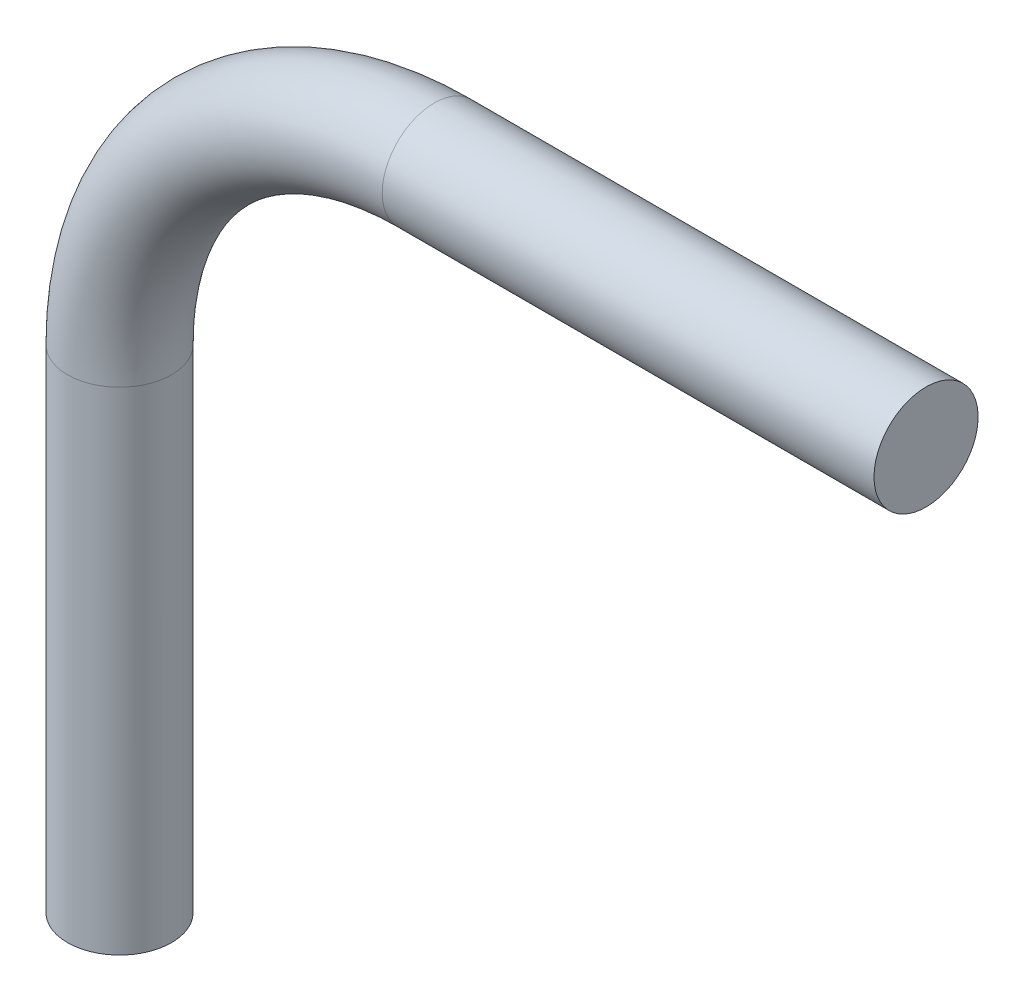
ISO-10303-21;
HEADER;
FILE_DESCRIPTION(('STEP AP214'),'2;1');
FILE_NAME('part.step','',(''),(''),'','','');
FILE_SCHEMA(('AUTOMOTIVE_DESIGN { 1 0 10303 214 1 1 1 1 }'));
ENDSEC;
DATA;
#1=APPLICATION_CONTEXT('core data for automotive mechanical design processes');
#2=APPLICATION_PROTOCOL_DEFINITION('international standard','automotive_design',2000,#1);
#3=PRODUCT_CONTEXT('',#1,'mechanical');
#4=PRODUCT('Part','Part','',(#3));
#5=PRODUCT_RELATED_PRODUCT_CATEGORY('part','',(#4));
#6=PRODUCT_DEFINITION_FORMATION('','',#4);
#7=PRODUCT_DEFINITION_CONTEXT('part definition',#1,'design');
#8=PRODUCT_DEFINITION('design','',#6,#7);
#9=PRODUCT_DEFINITION_SHAPE('','',#8);
#10=(LENGTH_UNIT() NAMED_UNIT(*) SI_UNIT(.MILLI.,.METRE.));
#11=(NAMED_UNIT(*) PLANE_ANGLE_UNIT() SI_UNIT($,.RADIAN.));
#12=(NAMED_UNIT(*) SI_UNIT($,.STERADIAN.) SOLID_ANGLE_UNIT());
#13=UNCERTAINTY_MEASURE_WITH_UNIT(LENGTH_MEASURE(1.E-05),#10,'distance_accuracy_value','');
#14=(GEOMETRIC_REPRESENTATION_CONTEXT(3) GLOBAL_UNCERTAINTY_ASSIGNED_CONTEXT((#13)) GLOBAL_UNIT_ASSIGNED_CONTEXT((#10,
#11,#12)) REPRESENTATION_CONTEXT('',''));
#15=CARTESIAN_POINT('',(0.,0.,0.));
#16=DIRECTION('',(0.,0.,1.));
#17=DIRECTION('',(1.,0.,0.));
#18=AXIS2_PLACEMENT_3D('',#15,#16,#17);
#19=CARTESIAN_POINT('',(30.,19.2,0.));
#20=DIRECTION('',(1.,0.,0.));
#21=DIRECTION('',(0.,0.,1.));
#22=AXIS2_PLACEMENT_3D('',#19,#20,#21);
#23=PLANE('',#22);
#24=CARTESIAN_POINT('',(30.,19.2,0.));
#25=DIRECTION('',(1.,0.,0.));
#26=DIRECTION('',(0.,0.,1.));
#27=AXIS2_PLACEMENT_3D('',#24,#25,#26);
#28=CIRCLE('',#27,3.175);
#29=CARTESIAN_POINT('',(30.,19.2,3.175));
#30=VERTEX_POINT('',#29);
#31=EDGE_CURVE('E70',#30,#30,#28,.T.);
#32=ORIENTED_EDGE('',*,*,#31,.T.);
#33=EDGE_LOOP('',(#32));
#34=FACE_BOUND('',#33,.T.);
#35=ADVANCED_FACE('F53',(#34),#23,.T.);
#36=CARTESIAN_POINT('',(-19.2,-30.,0.));
#37=DIRECTION('',(0.,1.,0.));
#38=DIRECTION('',(0.,0.,1.));
#39=AXIS2_PLACEMENT_3D('',#36,#37,#38);
#40=PLANE('',#39);
#41=CARTESIAN_POINT('',(-19.2,-30.,0.));
#42=DIRECTION('',(0.,1.,0.));
#43=DIRECTION('',(0.,0.,1.));
#44=AXIS2_PLACEMENT_3D('',#41,#42,#43);
#45=CIRCLE('',#44,3.175);
#46=CARTESIAN_POINT('',(-19.2,-30.,3.175));
#47=VERTEX_POINT('',#46);
#48=EDGE_CURVE('E11',#47,#47,#45,.T.);
#49=ORIENTED_EDGE('',*,*,#48,.F.);
#50=EDGE_LOOP('',(#49));
#51=FACE_BOUND('',#50,.T.);
#52=ADVANCED_FACE('F81',(#51),#40,.F.);
#53=CARTESIAN_POINT('',(30.,19.2,0.));
#54=DIRECTION('',(-1.,0.,0.));
#55=DIRECTION('',(0.,0.,1.));
#56=AXIS2_PLACEMENT_3D('',#53,#54,#55);
#57=CYLINDRICAL_SURFACE('',#56,3.175);
#58=CARTESIAN_POINT('',(0.,19.2,0.));
#59=DIRECTION('',(1.,0.,0.));
#60=DIRECTION('',(0.,0.,1.));
#61=AXIS2_PLACEMENT_3D('',#58,#59,#60);
#62=CIRCLE('',#61,3.175);
#63=CARTESIAN_POINT('',(0.,22.375,0.));
#64=VERTEX_POINT('',#63);
#65=EDGE_CURVE('E65',#64,#64,#62,.T.);
#66=ORIENTED_EDGE('',*,*,#65,.T.);
#67=EDGE_LOOP('',(#66));
#68=FACE_BOUND('',#67,.T.);
#69=ORIENTED_EDGE('',*,*,#31,.F.);
#70=EDGE_LOOP('',(#69));
#71=FACE_BOUND('',#70,.T.);
#72=ADVANCED_FACE('F78',(#68,#71),#57,.T.);
#73=CARTESIAN_POINT('',(0.,0.,0.));
#74=DIRECTION('',(0.,0.,1.));
#75=DIRECTION('',(1.,0.,0.));
#76=AXIS2_PLACEMENT_3D('',#73,#74,#75);
#77=TOROIDAL_SURFACE('',#76,19.2,3.175);
#78=CARTESIAN_POINT('',(-19.2,0.,0.));
#79=DIRECTION('',(0.,1.,0.));
#80=DIRECTION('',(0.,0.,1.));
#81=AXIS2_PLACEMENT_3D('',#78,#79,#80);
#82=CIRCLE('',#81,3.175);
#83=CARTESIAN_POINT('',(-22.375,0.,0.));
#84=VERTEX_POINT('',#83);
#85=EDGE_CURVE('E60',#84,#84,#82,.T.);
#86=CARTESIAN_POINT('',(0.,0.,0.));
#87=DIRECTION('',(0.,0.,1.));
#88=DIRECTION('',(1.,0.,0.));
#89=AXIS2_PLACEMENT_3D('',#86,#87,#88);
#90=CIRCLE('',#89,22.375);
#91=EDGE_CURVE('',#64,#84,#90,.T.);
#92=ORIENTED_EDGE('',*,*,#65,.F.);
#93=ORIENTED_EDGE('',*,*,#85,.T.);
#94=ORIENTED_EDGE('',*,*,#91,.T.);
#95=ORIENTED_EDGE('',*,*,#91,.F.);
#96=EDGE_LOOP('',(#92,#94,#93,#95));
#97=FACE_BOUND('',#96,.T.);
#98=ADVANCED_FACE('F80',(#97),#77,.T.);
#99=CARTESIAN_POINT('',(-19.2,0.,0.));
#100=DIRECTION('',(0.,-1.,0.));
#101=DIRECTION('',(1.,0.,0.));
#102=AXIS2_PLACEMENT_3D('',#99,#100,#101);
#103=CYLINDRICAL_SURFACE('',#102,3.175);
#104=ORIENTED_EDGE('',*,*,#48,.T.);
#105=EDGE_LOOP('',(#104));
#106=FACE_BOUND('',#105,.T.);
#107=ORIENTED_EDGE('',*,*,#85,.F.);
#108=EDGE_LOOP('',(#107));
#109=FACE_BOUND('',#108,.T.);
#110=ADVANCED_FACE('F88',(#106,#109),#103,.T.);
#111=CLOSED_SHELL('',(#35,#52,#72,#98,#110));
#112=MANIFOLD_SOLID_BREP('B2',#111);
#113=ADVANCED_BREP_SHAPE_REPRESENTATION('',(#18,#112),#14);
#114=SHAPE_DEFINITION_REPRESENTATION(#9,#113);
ENDSEC;
END-ISO-10303-21;
